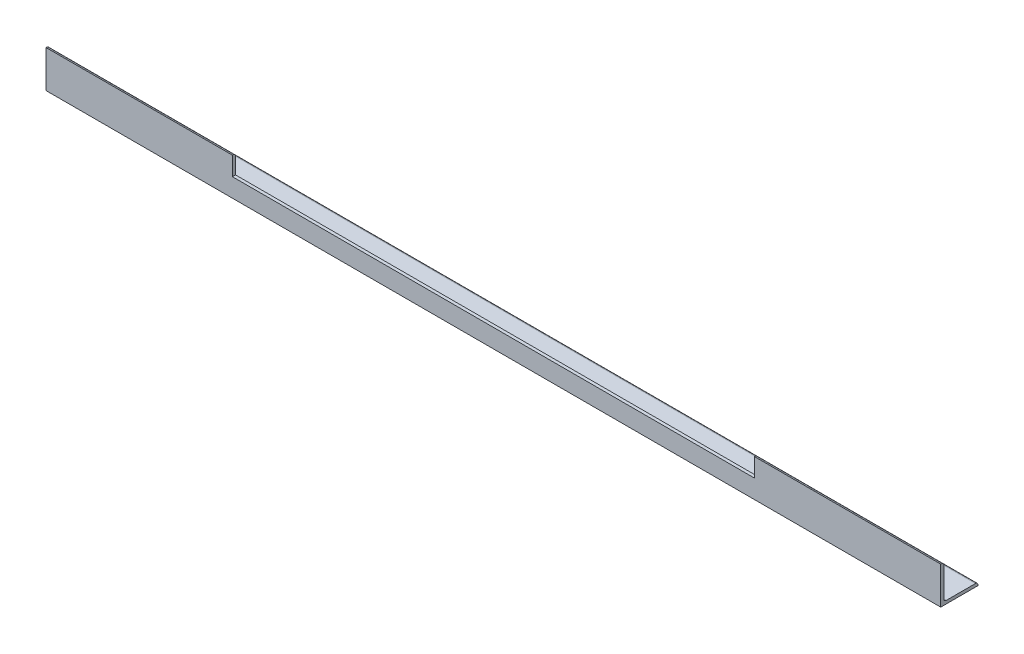
ISO-10303-21;
HEADER;
FILE_DESCRIPTION(('STEP AP214'),'2;1');
FILE_NAME('part.step','',(''),(''),'','','');
FILE_SCHEMA(('AUTOMOTIVE_DESIGN { 1 0 10303 214 1 1 1 1 }'));
ENDSEC;
DATA;
#1=APPLICATION_CONTEXT('core data for automotive mechanical design processes');
#2=APPLICATION_PROTOCOL_DEFINITION('international standard','automotive_design',2000,#1);
#3=PRODUCT_CONTEXT('',#1,'mechanical');
#4=PRODUCT('Part','Part','',(#3));
#5=PRODUCT_RELATED_PRODUCT_CATEGORY('part','',(#4));
#6=PRODUCT_DEFINITION_FORMATION('','',#4);
#7=PRODUCT_DEFINITION_CONTEXT('part definition',#1,'design');
#8=PRODUCT_DEFINITION('design','',#6,#7);
#9=PRODUCT_DEFINITION_SHAPE('','',#8);
#10=(LENGTH_UNIT() NAMED_UNIT(*) SI_UNIT(.MILLI.,.METRE.));
#11=(NAMED_UNIT(*) PLANE_ANGLE_UNIT() SI_UNIT($,.RADIAN.));
#12=(NAMED_UNIT(*) SI_UNIT($,.STERADIAN.) SOLID_ANGLE_UNIT());
#13=UNCERTAINTY_MEASURE_WITH_UNIT(LENGTH_MEASURE(1.E-05),#10,'distance_accuracy_value','');
#14=(GEOMETRIC_REPRESENTATION_CONTEXT(3) GLOBAL_UNCERTAINTY_ASSIGNED_CONTEXT((#13)) GLOBAL_UNIT_ASSIGNED_CONTEXT((#10,
#11,#12)) REPRESENTATION_CONTEXT('',''));
#15=CARTESIAN_POINT('',(0.,0.,0.));
#16=DIRECTION('',(0.,0.,1.));
#17=DIRECTION('',(1.,0.,0.));
#18=AXIS2_PLACEMENT_3D('',#15,#16,#17);
#19=CARTESIAN_POINT('',(-914.4,76.2,0.));
#20=DIRECTION('',(0.,1.,0.));
#21=DIRECTION('',(0.,0.,1.));
#22=AXIS2_PLACEMENT_3D('',#19,#20,#21);
#23=PLANE('',#22);
#24=DIRECTION('',(0.,0.,1.));
#25=VECTOR('',#24,1.);
#26=CARTESIAN_POINT('',(-533.4,76.2,-76.2));
#27=LINE('',#26,#25);
#28=CARTESIAN_POINT('',(-533.4,76.2,-1.27000000000002));
#29=VERTEX_POINT('',#28);
#30=CARTESIAN_POINT('',(-533.4,76.2,0.));
#31=VERTEX_POINT('',#30);
#32=EDGE_CURVE('E162',#29,#31,#27,.T.);
#33=ORIENTED_EDGE('',*,*,#32,.F.);
#34=DIRECTION('',(1.,0.,0.));
#35=VECTOR('',#34,1.);
#36=CARTESIAN_POINT('',(-914.4,76.2,-1.26999999999996));
#37=LINE('',#36,#35);
#38=CARTESIAN_POINT('',(-914.4,76.2,-1.26999999999996));
#39=VERTEX_POINT('',#38);
#40=EDGE_CURVE('E11',#39,#29,#37,.T.);
#41=ORIENTED_EDGE('',*,*,#40,.F.);
#42=DIRECTION('',(0.,0.,1.));
#43=VECTOR('',#42,1.);
#44=CARTESIAN_POINT('',(-914.4,76.2,0.));
#45=LINE('',#44,#43);
#46=CARTESIAN_POINT('',(-914.4,76.2,0.));
#47=VERTEX_POINT('',#46);
#48=EDGE_CURVE('E201',#39,#47,#45,.T.);
#49=ORIENTED_EDGE('',*,*,#48,.T.);
#50=DIRECTION('',(1.,0.,0.));
#51=VECTOR('',#50,1.);
#52=CARTESIAN_POINT('',(-914.4,76.2,0.));
#53=LINE('',#52,#51);
#54=EDGE_CURVE('E37',#47,#31,#53,.T.);
#55=ORIENTED_EDGE('',*,*,#54,.T.);
#56=EDGE_LOOP('',(#33,#41,#49,#55));
#57=FACE_BOUND('',#56,.T.);
#58=ADVANCED_FACE('F33',(#57),#23,.T.);
#59=CARTESIAN_POINT('',(-914.4,71.12,-1.27));
#60=DIRECTION('',(1.,0.,0.));
#61=DIRECTION('',(0.,0.,-1.));
#62=AXIS2_PLACEMENT_3D('',#59,#60,#61);
#63=CYLINDRICAL_SURFACE('',#62,5.08);
#64=CARTESIAN_POINT('',(-533.4,71.12,-1.27));
#65=DIRECTION('',(-1.,0.,0.));
#66=DIRECTION('',(0.,0.,1.));
#67=AXIS2_PLACEMENT_3D('',#64,#65,#66);
#68=CIRCLE('',#67,5.08);
#69=CARTESIAN_POINT('',(-533.4,71.12,-6.35));
#70=VERTEX_POINT('',#69);
#71=EDGE_CURVE('E172',#70,#29,#68,.F.);
#72=ORIENTED_EDGE('',*,*,#71,.F.);
#73=DIRECTION('',(1.,0.,0.));
#74=VECTOR('',#73,1.);
#75=CARTESIAN_POINT('',(-914.4,71.12,-6.35));
#76=LINE('',#75,#74);
#77=CARTESIAN_POINT('',(-914.4,71.12,-6.35));
#78=VERTEX_POINT('',#77);
#79=EDGE_CURVE('E227',#78,#70,#76,.T.);
#80=ORIENTED_EDGE('',*,*,#79,.F.);
#81=CARTESIAN_POINT('',(-914.4,71.12,-1.27));
#82=DIRECTION('',(1.,0.,0.));
#83=DIRECTION('',(0.,0.,-1.));
#84=AXIS2_PLACEMENT_3D('',#81,#82,#83);
#85=CIRCLE('',#84,5.08);
#86=EDGE_CURVE('E224',#78,#39,#85,.T.);
#87=ORIENTED_EDGE('',*,*,#86,.T.);
#88=ORIENTED_EDGE('',*,*,#40,.T.);
#89=EDGE_LOOP('',(#72,#80,#87,#88));
#90=FACE_BOUND('',#89,.T.);
#91=ADVANCED_FACE('F260',(#90),#63,.T.);
#92=DIRECTION('',(0.,0.,1.));
#93=VECTOR('',#92,1.);
#94=CARTESIAN_POINT('',(533.4,76.2,-76.2));
#95=LINE('',#94,#93);
#96=CARTESIAN_POINT('',(533.4,76.2,-1.27));
#97=VERTEX_POINT('',#96);
#98=CARTESIAN_POINT('',(533.4,76.2,0.));
#99=VERTEX_POINT('',#98);
#100=EDGE_CURVE('E146',#97,#99,#95,.T.);
#101=ORIENTED_EDGE('',*,*,#100,.T.);
#102=CARTESIAN_POINT('',(914.4,76.2,0.));
#103=VERTEX_POINT('',#102);
#104=EDGE_CURVE('E157',#99,#103,#53,.T.);
#105=ORIENTED_EDGE('',*,*,#104,.T.);
#106=DIRECTION('',(0.,0.,1.));
#107=VECTOR('',#106,1.);
#108=CARTESIAN_POINT('',(914.4,76.2,0.));
#109=LINE('',#108,#107);
#110=CARTESIAN_POINT('',(914.4,76.2,-1.26999999999996));
#111=VERTEX_POINT('',#110);
#112=EDGE_CURVE('E174',#111,#103,#109,.T.);
#113=ORIENTED_EDGE('',*,*,#112,.F.);
#114=EDGE_CURVE('E42',#97,#111,#37,.T.);
#115=ORIENTED_EDGE('',*,*,#114,.F.);
#116=EDGE_LOOP('',(#101,#105,#113,#115));
#117=FACE_BOUND('',#116,.T.);
#118=ADVANCED_FACE('F35',(#117),#23,.T.);
#119=CARTESIAN_POINT('',(533.4,71.12,-1.27));
#120=DIRECTION('',(1.,0.,0.));
#121=DIRECTION('',(0.,0.,-1.));
#122=AXIS2_PLACEMENT_3D('',#119,#120,#121);
#123=CIRCLE('',#122,5.08);
#124=CARTESIAN_POINT('',(533.4,71.12,-6.35));
#125=VERTEX_POINT('',#124);
#126=EDGE_CURVE('E168',#97,#125,#123,.F.);
#127=ORIENTED_EDGE('',*,*,#126,.F.);
#128=ORIENTED_EDGE('',*,*,#114,.T.);
#129=CARTESIAN_POINT('',(914.4,71.12,-1.27));
#130=DIRECTION('',(1.,0.,0.));
#131=DIRECTION('',(0.,0.,-1.));
#132=AXIS2_PLACEMENT_3D('',#129,#130,#131);
#133=CIRCLE('',#132,5.08);
#134=CARTESIAN_POINT('',(914.4,71.12,-6.35));
#135=VERTEX_POINT('',#134);
#136=EDGE_CURVE('E198',#135,#111,#133,.T.);
#137=ORIENTED_EDGE('',*,*,#136,.F.);
#138=EDGE_CURVE('E230',#125,#135,#76,.T.);
#139=ORIENTED_EDGE('',*,*,#138,.F.);
#140=EDGE_LOOP('',(#127,#128,#137,#139));
#141=FACE_BOUND('',#140,.T.);
#142=ADVANCED_FACE('F253',(#141),#63,.T.);
#143=CARTESIAN_POINT('',(-914.4,71.12,-6.35));
#144=DIRECTION('',(0.,0.,-1.));
#145=DIRECTION('',(-1.,0.,0.));
#146=AXIS2_PLACEMENT_3D('',#143,#144,#145);
#147=PLANE('',#146);
#148=DIRECTION('',(0.,1.,0.));
#149=VECTOR('',#148,1.);
#150=CARTESIAN_POINT('',(-533.4,71.12,-6.35));
#151=LINE('',#150,#149);
#152=CARTESIAN_POINT('',(-533.4,38.1,-6.35000000000002));
#153=VERTEX_POINT('',#152);
#154=EDGE_CURVE('E170',#153,#70,#151,.T.);
#155=ORIENTED_EDGE('',*,*,#154,.F.);
#156=DIRECTION('',(-1.,0.,0.));
#157=VECTOR('',#156,1.);
#158=CARTESIAN_POINT('',(-914.4,38.1,-6.35));
#159=LINE('',#158,#157);
#160=CARTESIAN_POINT('',(533.4,38.1,-6.35000000000002));
#161=VERTEX_POINT('',#160);
#162=EDGE_CURVE('E164',#161,#153,#159,.T.);
#163=ORIENTED_EDGE('',*,*,#162,.F.);
#164=DIRECTION('',(0.,-1.,0.));
#165=VECTOR('',#164,1.);
#166=CARTESIAN_POINT('',(533.4,71.12,-6.35));
#167=LINE('',#166,#165);
#168=EDGE_CURVE('E143',#125,#161,#167,.T.);
#169=ORIENTED_EDGE('',*,*,#168,.F.);
#170=ORIENTED_EDGE('',*,*,#138,.T.);
#171=DIRECTION('',(0.,1.,0.));
#172=VECTOR('',#171,1.);
#173=CARTESIAN_POINT('',(914.4,71.12,-6.35));
#174=LINE('',#173,#172);
#175=CARTESIAN_POINT('',(914.4,11.43,-6.35));
#176=VERTEX_POINT('',#175);
#177=EDGE_CURVE('E195',#176,#135,#174,.T.);
#178=ORIENTED_EDGE('',*,*,#177,.F.);
#179=DIRECTION('',(1.,0.,0.));
#180=VECTOR('',#179,1.);
#181=CARTESIAN_POINT('',(-914.4,11.43,-6.35));
#182=LINE('',#181,#180);
#183=CARTESIAN_POINT('',(-914.4,11.43,-6.35));
#184=VERTEX_POINT('',#183);
#185=EDGE_CURVE('E231',#184,#176,#182,.T.);
#186=ORIENTED_EDGE('',*,*,#185,.F.);
#187=DIRECTION('',(0.,1.,0.));
#188=VECTOR('',#187,1.);
#189=CARTESIAN_POINT('',(-914.4,71.12,-6.35));
#190=LINE('',#189,#188);
#191=EDGE_CURVE('E221',#184,#78,#190,.T.);
#192=ORIENTED_EDGE('',*,*,#191,.T.);
#193=ORIENTED_EDGE('',*,*,#79,.T.);
#194=EDGE_LOOP('',(#155,#163,#169,#170,#178,#186,#192,#193));
#195=FACE_BOUND('',#194,.T.);
#196=ADVANCED_FACE('F256',(#195),#147,.T.);
#197=CARTESIAN_POINT('',(-914.4,11.43,-11.43));
#198=DIRECTION('',(1.,0.,0.));
#199=DIRECTION('',(0.,0.,-1.));
#200=AXIS2_PLACEMENT_3D('',#197,#198,#199);
#201=CYLINDRICAL_SURFACE('',#200,5.08);
#202=ORIENTED_EDGE('',*,*,#185,.T.);
#203=CARTESIAN_POINT('',(914.4,11.43,-11.43));
#204=DIRECTION('',(-1.,0.,0.));
#205=DIRECTION('',(0.,0.,-1.));
#206=AXIS2_PLACEMENT_3D('',#203,#204,#205);
#207=CIRCLE('',#206,5.08);
#208=CARTESIAN_POINT('',(914.4,6.35,-11.43));
#209=VERTEX_POINT('',#208);
#210=EDGE_CURVE('E192',#209,#176,#207,.T.);
#211=ORIENTED_EDGE('',*,*,#210,.F.);
#212=DIRECTION('',(1.,0.,0.));
#213=VECTOR('',#212,1.);
#214=CARTESIAN_POINT('',(-914.4,6.35,-11.43));
#215=LINE('',#214,#213);
#216=CARTESIAN_POINT('',(-914.4,6.35,-11.43));
#217=VERTEX_POINT('',#216);
#218=EDGE_CURVE('E233',#217,#209,#215,.T.);
#219=ORIENTED_EDGE('',*,*,#218,.F.);
#220=CARTESIAN_POINT('',(-914.4,11.43,-11.43));
#221=DIRECTION('',(-1.,0.,0.));
#222=DIRECTION('',(0.,0.,-1.));
#223=AXIS2_PLACEMENT_3D('',#220,#221,#222);
#224=CIRCLE('',#223,5.08);
#225=EDGE_CURVE('E218',#217,#184,#224,.T.);
#226=ORIENTED_EDGE('',*,*,#225,.T.);
#227=EDGE_LOOP('',(#202,#211,#219,#226));
#228=FACE_BOUND('',#227,.T.);
#229=ADVANCED_FACE('F280',(#228),#201,.F.);
#230=CARTESIAN_POINT('',(-914.4,6.35,-11.43));
#231=DIRECTION('',(0.,1.,0.));
#232=DIRECTION('',(0.,0.,1.));
#233=AXIS2_PLACEMENT_3D('',#230,#231,#232);
#234=PLANE('',#233);
#235=ORIENTED_EDGE('',*,*,#218,.T.);
#236=DIRECTION('',(0.,0.,1.));
#237=VECTOR('',#236,1.);
#238=CARTESIAN_POINT('',(914.4,6.35,-11.43));
#239=LINE('',#238,#237);
#240=CARTESIAN_POINT('',(914.4,6.35,-71.12));
#241=VERTEX_POINT('',#240);
#242=EDGE_CURVE('E189',#241,#209,#239,.T.);
#243=ORIENTED_EDGE('',*,*,#242,.F.);
#244=DIRECTION('',(1.,0.,0.));
#245=VECTOR('',#244,1.);
#246=CARTESIAN_POINT('',(-914.4,6.35,-71.12));
#247=LINE('',#246,#245);
#248=CARTESIAN_POINT('',(-914.4,6.35,-71.12));
#249=VERTEX_POINT('',#248);
#250=EDGE_CURVE('E235',#249,#241,#247,.T.);
#251=ORIENTED_EDGE('',*,*,#250,.F.);
#252=DIRECTION('',(0.,0.,1.));
#253=VECTOR('',#252,1.);
#254=CARTESIAN_POINT('',(-914.4,6.35,-11.43));
#255=LINE('',#254,#253);
#256=EDGE_CURVE('E215',#249,#217,#255,.T.);
#257=ORIENTED_EDGE('',*,*,#256,.T.);
#258=EDGE_LOOP('',(#235,#243,#251,#257));
#259=FACE_BOUND('',#258,.T.);
#260=ADVANCED_FACE('F287',(#259),#234,.T.);
#261=CARTESIAN_POINT('',(-914.4,1.27,-71.12));
#262=DIRECTION('',(1.,0.,0.));
#263=DIRECTION('',(0.,0.,-1.));
#264=AXIS2_PLACEMENT_3D('',#261,#262,#263);
#265=CYLINDRICAL_SURFACE('',#264,5.08);
#266=ORIENTED_EDGE('',*,*,#250,.T.);
#267=CARTESIAN_POINT('',(914.4,1.27,-71.12));
#268=DIRECTION('',(1.,0.,0.));
#269=DIRECTION('',(0.,0.,1.));
#270=AXIS2_PLACEMENT_3D('',#267,#268,#269);
#271=CIRCLE('',#270,5.08);
#272=CARTESIAN_POINT('',(914.4,1.26999999999996,-76.2));
#273=VERTEX_POINT('',#272);
#274=EDGE_CURVE('E186',#273,#241,#271,.T.);
#275=ORIENTED_EDGE('',*,*,#274,.F.);
#276=DIRECTION('',(1.,0.,0.));
#277=VECTOR('',#276,1.);
#278=CARTESIAN_POINT('',(-914.4,1.26999999999996,-76.2));
#279=LINE('',#278,#277);
#280=CARTESIAN_POINT('',(-914.4,1.26999999999996,-76.2));
#281=VERTEX_POINT('',#280);
#282=EDGE_CURVE('E237',#281,#273,#279,.T.);
#283=ORIENTED_EDGE('',*,*,#282,.F.);
#284=CARTESIAN_POINT('',(-914.4,1.27,-71.12));
#285=DIRECTION('',(1.,0.,0.));
#286=DIRECTION('',(0.,0.,1.));
#287=AXIS2_PLACEMENT_3D('',#284,#285,#286);
#288=CIRCLE('',#287,5.08);
#289=EDGE_CURVE('E212',#281,#249,#288,.T.);
#290=ORIENTED_EDGE('',*,*,#289,.T.);
#291=EDGE_LOOP('',(#266,#275,#283,#290));
#292=FACE_BOUND('',#291,.T.);
#293=ADVANCED_FACE('F291',(#292),#265,.T.);
#294=CARTESIAN_POINT('',(-914.4,1.26999999999996,-76.2));
#295=DIRECTION('',(0.,0.,-1.));
#296=DIRECTION('',(-1.,0.,0.));
#297=AXIS2_PLACEMENT_3D('',#294,#295,#296);
#298=PLANE('',#297);
#299=ORIENTED_EDGE('',*,*,#282,.T.);
#300=DIRECTION('',(0.,1.,0.));
#301=VECTOR('',#300,1.);
#302=CARTESIAN_POINT('',(914.4,1.26999999999996,-76.2));
#303=LINE('',#302,#301);
#304=CARTESIAN_POINT('',(914.4,0.,-76.2));
#305=VERTEX_POINT('',#304);
#306=EDGE_CURVE('E183',#305,#273,#303,.T.);
#307=ORIENTED_EDGE('',*,*,#306,.F.);
#308=DIRECTION('',(1.,0.,0.));
#309=VECTOR('',#308,1.);
#310=CARTESIAN_POINT('',(-914.4,0.,-76.2));
#311=LINE('',#310,#309);
#312=CARTESIAN_POINT('',(-914.4,0.,-76.2));
#313=VERTEX_POINT('',#312);
#314=EDGE_CURVE('E239',#313,#305,#311,.T.);
#315=ORIENTED_EDGE('',*,*,#314,.F.);
#316=DIRECTION('',(0.,1.,0.));
#317=VECTOR('',#316,1.);
#318=CARTESIAN_POINT('',(-914.4,1.26999999999996,-76.2));
#319=LINE('',#318,#317);
#320=EDGE_CURVE('E209',#313,#281,#319,.T.);
#321=ORIENTED_EDGE('',*,*,#320,.T.);
#322=EDGE_LOOP('',(#299,#307,#315,#321));
#323=FACE_BOUND('',#322,.T.);
#324=ADVANCED_FACE('F295',(#323),#298,.T.);
#325=CARTESIAN_POINT('',(-914.4,0.,0.));
#326=DIRECTION('',(0.,-1.,0.));
#327=DIRECTION('',(0.,0.,-1.));
#328=AXIS2_PLACEMENT_3D('',#325,#326,#327);
#329=PLANE('',#328);
#330=ORIENTED_EDGE('',*,*,#314,.T.);
#331=DIRECTION('',(0.,0.,-1.));
#332=VECTOR('',#331,1.);
#333=CARTESIAN_POINT('',(914.4,0.,0.));
#334=LINE('',#333,#332);
#335=CARTESIAN_POINT('',(914.4,0.,0.));
#336=VERTEX_POINT('',#335);
#337=EDGE_CURVE('E180',#336,#305,#334,.T.);
#338=ORIENTED_EDGE('',*,*,#337,.F.);
#339=DIRECTION('',(1.,0.,0.));
#340=VECTOR('',#339,1.);
#341=CARTESIAN_POINT('',(-914.4,0.,0.));
#342=LINE('',#341,#340);
#343=CARTESIAN_POINT('',(-914.4,0.,0.));
#344=VERTEX_POINT('',#343);
#345=EDGE_CURVE('E240',#344,#336,#342,.T.);
#346=ORIENTED_EDGE('',*,*,#345,.F.);
#347=DIRECTION('',(0.,0.,-1.));
#348=VECTOR('',#347,1.);
#349=CARTESIAN_POINT('',(-914.4,0.,0.));
#350=LINE('',#349,#348);
#351=EDGE_CURVE('E206',#344,#313,#350,.T.);
#352=ORIENTED_EDGE('',*,*,#351,.T.);
#353=EDGE_LOOP('',(#330,#338,#346,#352));
#354=FACE_BOUND('',#353,.T.);
#355=ADVANCED_FACE('F299',(#354),#329,.T.);
#356=CARTESIAN_POINT('',(-914.4,76.2,0.));
#357=DIRECTION('',(0.,0.,1.));
#358=DIRECTION('',(1.,0.,0.));
#359=AXIS2_PLACEMENT_3D('',#356,#357,#358);
#360=PLANE('',#359);
#361=DIRECTION('',(0.,-1.,0.));
#362=VECTOR('',#361,1.);
#363=CARTESIAN_POINT('',(-533.4,76.2,0.));
#364=LINE('',#363,#362);
#365=CARTESIAN_POINT('',(-533.4,38.1,0.));
#366=VERTEX_POINT('',#365);
#367=EDGE_CURVE('E50',#31,#366,#364,.T.);
#368=ORIENTED_EDGE('',*,*,#367,.F.);
#369=ORIENTED_EDGE('',*,*,#54,.F.);
#370=DIRECTION('',(0.,-1.,0.));
#371=VECTOR('',#370,1.);
#372=CARTESIAN_POINT('',(-914.4,76.2,0.));
#373=LINE('',#372,#371);
#374=EDGE_CURVE('E203',#47,#344,#373,.T.);
#375=ORIENTED_EDGE('',*,*,#374,.T.);
#376=ORIENTED_EDGE('',*,*,#345,.T.);
#377=DIRECTION('',(0.,-1.,0.));
#378=VECTOR('',#377,1.);
#379=CARTESIAN_POINT('',(914.4,76.2,0.));
#380=LINE('',#379,#378);
#381=EDGE_CURVE('E177',#103,#336,#380,.T.);
#382=ORIENTED_EDGE('',*,*,#381,.F.);
#383=ORIENTED_EDGE('',*,*,#104,.F.);
#384=DIRECTION('',(0.,1.,0.));
#385=VECTOR('',#384,1.);
#386=CARTESIAN_POINT('',(533.4,76.2,0.));
#387=LINE('',#386,#385);
#388=CARTESIAN_POINT('',(533.4,38.1,0.));
#389=VERTEX_POINT('',#388);
#390=EDGE_CURVE('E140',#389,#99,#387,.T.);
#391=ORIENTED_EDGE('',*,*,#390,.F.);
#392=DIRECTION('',(1.,0.,0.));
#393=VECTOR('',#392,1.);
#394=CARTESIAN_POINT('',(-533.4,38.1,0.));
#395=LINE('',#394,#393);
#396=EDGE_CURVE('E150',#366,#389,#395,.T.);
#397=ORIENTED_EDGE('',*,*,#396,.F.);
#398=EDGE_LOOP('',(#368,#369,#375,#376,#382,#383,#391,#397));
#399=FACE_BOUND('',#398,.T.);
#400=ADVANCED_FACE('F155',(#399),#360,.T.);
#401=CARTESIAN_POINT('',(-914.4,71.12,-1.27));
#402=DIRECTION('',(1.,0.,0.));
#403=DIRECTION('',(0.,0.,-1.));
#404=AXIS2_PLACEMENT_3D('',#401,#402,#403);
#405=PLANE('',#404);
#406=ORIENTED_EDGE('',*,*,#48,.F.);
#407=ORIENTED_EDGE('',*,*,#86,.F.);
#408=ORIENTED_EDGE('',*,*,#191,.F.);
#409=ORIENTED_EDGE('',*,*,#225,.F.);
#410=ORIENTED_EDGE('',*,*,#256,.F.);
#411=ORIENTED_EDGE('',*,*,#289,.F.);
#412=ORIENTED_EDGE('',*,*,#320,.F.);
#413=ORIENTED_EDGE('',*,*,#351,.F.);
#414=ORIENTED_EDGE('',*,*,#374,.F.);
#415=EDGE_LOOP('',(#406,#407,#408,#409,#410,#411,#412,#413,#414));
#416=FACE_BOUND('',#415,.T.);
#417=ADVANCED_FACE('F265',(#416),#405,.F.);
#418=CARTESIAN_POINT('',(914.4,71.12,-1.27));
#419=DIRECTION('',(1.,0.,0.));
#420=DIRECTION('',(0.,0.,-1.));
#421=AXIS2_PLACEMENT_3D('',#418,#419,#420);
#422=PLANE('',#421);
#423=ORIENTED_EDGE('',*,*,#112,.T.);
#424=ORIENTED_EDGE('',*,*,#381,.T.);
#425=ORIENTED_EDGE('',*,*,#337,.T.);
#426=ORIENTED_EDGE('',*,*,#306,.T.);
#427=ORIENTED_EDGE('',*,*,#274,.T.);
#428=ORIENTED_EDGE('',*,*,#242,.T.);
#429=ORIENTED_EDGE('',*,*,#210,.T.);
#430=ORIENTED_EDGE('',*,*,#177,.T.);
#431=ORIENTED_EDGE('',*,*,#136,.T.);
#432=EDGE_LOOP('',(#423,#424,#425,#426,#427,#428,#429,#430,#431));
#433=FACE_BOUND('',#432,.T.);
#434=ADVANCED_FACE('F247',(#433),#422,.T.);
#435=CARTESIAN_POINT('',(-533.4,76.2,-76.2));
#436=DIRECTION('',(-1.,0.,0.));
#437=DIRECTION('',(0.,0.,1.));
#438=AXIS2_PLACEMENT_3D('',#435,#436,#437);
#439=PLANE('',#438);
#440=ORIENTED_EDGE('',*,*,#71,.T.);
#441=ORIENTED_EDGE('',*,*,#32,.T.);
#442=ORIENTED_EDGE('',*,*,#367,.T.);
#443=DIRECTION('',(0.,0.,1.));
#444=VECTOR('',#443,1.);
#445=CARTESIAN_POINT('',(-533.4,38.1,-76.2));
#446=LINE('',#445,#444);
#447=EDGE_CURVE('E147',#153,#366,#446,.T.);
#448=ORIENTED_EDGE('',*,*,#447,.F.);
#449=ORIENTED_EDGE('',*,*,#154,.T.);
#450=EDGE_LOOP('',(#440,#441,#442,#448,#449));
#451=FACE_BOUND('',#450,.T.);
#452=ADVANCED_FACE('F257',(#451),#439,.F.);
#453=CARTESIAN_POINT('',(533.4,76.2,-76.2));
#454=DIRECTION('',(1.,0.,0.));
#455=DIRECTION('',(0.,0.,-1.));
#456=AXIS2_PLACEMENT_3D('',#453,#454,#455);
#457=PLANE('',#456);
#458=ORIENTED_EDGE('',*,*,#126,.T.);
#459=ORIENTED_EDGE('',*,*,#168,.T.);
#460=DIRECTION('',(0.,0.,1.));
#461=VECTOR('',#460,1.);
#462=CARTESIAN_POINT('',(533.4,38.1,-76.2));
#463=LINE('',#462,#461);
#464=EDGE_CURVE('E136',#161,#389,#463,.T.);
#465=ORIENTED_EDGE('',*,*,#464,.T.);
#466=ORIENTED_EDGE('',*,*,#390,.T.);
#467=ORIENTED_EDGE('',*,*,#100,.F.);
#468=EDGE_LOOP('',(#458,#459,#465,#466,#467));
#469=FACE_BOUND('',#468,.T.);
#470=ADVANCED_FACE('F138',(#469),#457,.F.);
#471=CARTESIAN_POINT('',(-533.4,38.1,-76.2));
#472=DIRECTION('',(0.,-1.,0.));
#473=DIRECTION('',(0.,0.,-1.));
#474=AXIS2_PLACEMENT_3D('',#471,#472,#473);
#475=PLANE('',#474);
#476=ORIENTED_EDGE('',*,*,#162,.T.);
#477=ORIENTED_EDGE('',*,*,#447,.T.);
#478=ORIENTED_EDGE('',*,*,#396,.T.);
#479=ORIENTED_EDGE('',*,*,#464,.F.);
#480=EDGE_LOOP('',(#476,#477,#478,#479));
#481=FACE_BOUND('',#480,.T.);
#482=ADVANCED_FACE('F151',(#481),#475,.F.);
#483=CLOSED_SHELL('',(#58,#91,#118,#142,#196,#229,#260,#293,#324,#355,#400,#417,#434,#452,#470,#482));
#484=MANIFOLD_SOLID_BREP('B2',#483);
#485=ADVANCED_BREP_SHAPE_REPRESENTATION('',(#18,#484),#14);
#486=SHAPE_DEFINITION_REPRESENTATION(#9,#485);
ENDSEC;
END-ISO-10303-21;
